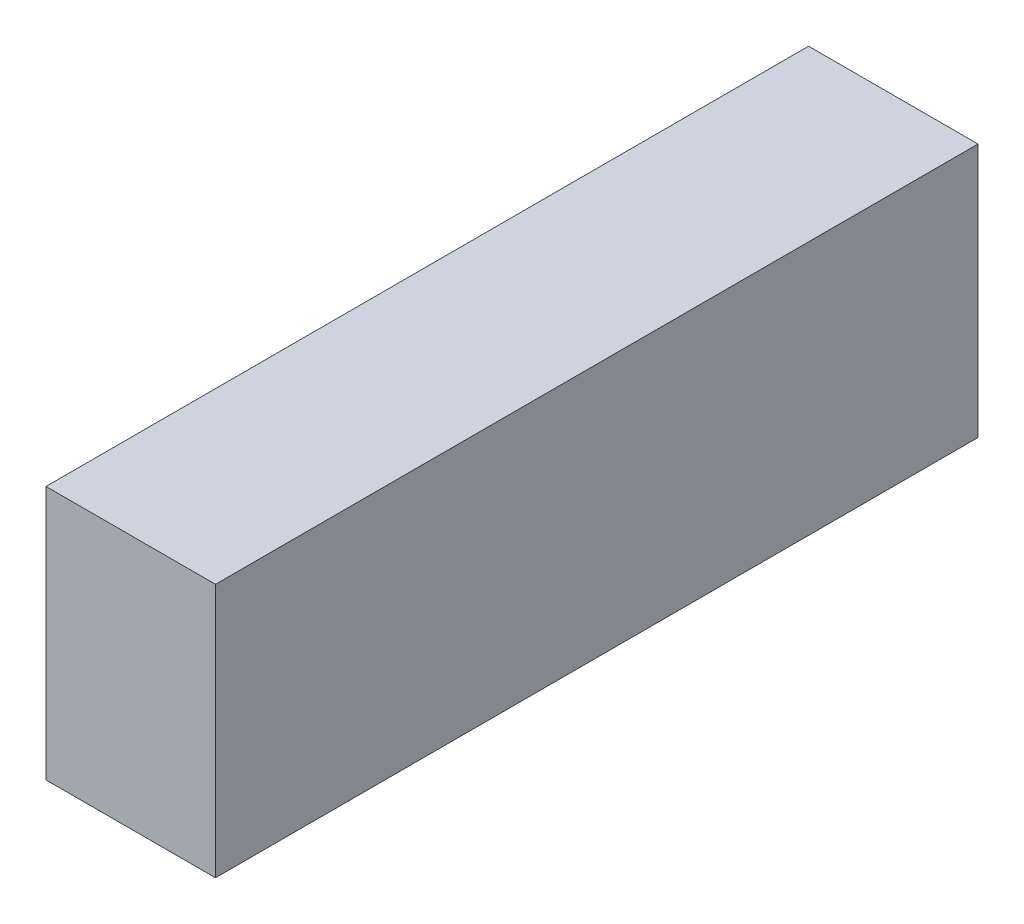
ISO-10303-21;
HEADER;
FILE_DESCRIPTION(('STEP AP214'),'2;1');
FILE_NAME('part.step','',(''),(''),'','','');
FILE_SCHEMA(('AUTOMOTIVE_DESIGN { 1 0 10303 214 1 1 1 1 }'));
ENDSEC;
DATA;
#1=APPLICATION_CONTEXT('core data for automotive mechanical design processes');
#2=APPLICATION_PROTOCOL_DEFINITION('international standard','automotive_design',2000,#1);
#3=PRODUCT_CONTEXT('',#1,'mechanical');
#4=PRODUCT('Part','Part','',(#3));
#5=PRODUCT_RELATED_PRODUCT_CATEGORY('part','',(#4));
#6=PRODUCT_DEFINITION_FORMATION('','',#4);
#7=PRODUCT_DEFINITION_CONTEXT('part definition',#1,'design');
#8=PRODUCT_DEFINITION('design','',#6,#7);
#9=PRODUCT_DEFINITION_SHAPE('','',#8);
#10=(LENGTH_UNIT() NAMED_UNIT(*) SI_UNIT(.MILLI.,.METRE.));
#11=(NAMED_UNIT(*) PLANE_ANGLE_UNIT() SI_UNIT($,.RADIAN.));
#12=(NAMED_UNIT(*) SI_UNIT($,.STERADIAN.) SOLID_ANGLE_UNIT());
#13=UNCERTAINTY_MEASURE_WITH_UNIT(LENGTH_MEASURE(1.E-05),#10,'distance_accuracy_value','');
#14=(GEOMETRIC_REPRESENTATION_CONTEXT(3) GLOBAL_UNCERTAINTY_ASSIGNED_CONTEXT((#13)) GLOBAL_UNIT_ASSIGNED_CONTEXT((#10,
#11,#12)) REPRESENTATION_CONTEXT('',''));
#15=CARTESIAN_POINT('',(0.,0.,0.));
#16=DIRECTION('',(0.,0.,1.));
#17=DIRECTION('',(1.,0.,0.));
#18=AXIS2_PLACEMENT_3D('',#15,#16,#17);
#19=CARTESIAN_POINT('',(4.23333333333333,-6.35,38.1));
#20=DIRECTION('',(-1.,0.,0.));
#21=DIRECTION('',(0.,0.,1.));
#22=AXIS2_PLACEMENT_3D('',#19,#20,#21);
#23=PLANE('',#22);
#24=DIRECTION('',(0.,1.,0.));
#25=VECTOR('',#24,1.);
#26=CARTESIAN_POINT('',(4.23333333333333,-6.35,0.));
#27=LINE('',#26,#25);
#28=CARTESIAN_POINT('',(4.23333333333333,-6.35,0.));
#29=VERTEX_POINT('',#28);
#30=CARTESIAN_POINT('',(4.23333333333333,6.35,0.));
#31=VERTEX_POINT('',#30);
#32=EDGE_CURVE('E95',#29,#31,#27,.T.);
#33=ORIENTED_EDGE('',*,*,#32,.T.);
#34=DIRECTION('',(0.,0.,-1.));
#35=VECTOR('',#34,1.);
#36=CARTESIAN_POINT('',(4.23333333333333,6.35,38.1));
#37=LINE('',#36,#35);
#38=CARTESIAN_POINT('',(4.23333333333333,6.35,38.1));
#39=VERTEX_POINT('',#38);
#40=EDGE_CURVE('E11',#39,#31,#37,.T.);
#41=ORIENTED_EDGE('',*,*,#40,.F.);
#42=DIRECTION('',(0.,1.,0.));
#43=VECTOR('',#42,1.);
#44=CARTESIAN_POINT('',(4.23333333333333,-6.35,38.1));
#45=LINE('',#44,#43);
#46=CARTESIAN_POINT('',(4.23333333333333,-6.35,38.1));
#47=VERTEX_POINT('',#46);
#48=EDGE_CURVE('E83',#47,#39,#45,.T.);
#49=ORIENTED_EDGE('',*,*,#48,.F.);
#50=DIRECTION('',(0.,0.,-1.));
#51=VECTOR('',#50,1.);
#52=CARTESIAN_POINT('',(4.23333333333333,-6.35,38.1));
#53=LINE('',#52,#51);
#54=EDGE_CURVE('E91',#47,#29,#53,.T.);
#55=ORIENTED_EDGE('',*,*,#54,.T.);
#56=EDGE_LOOP('',(#33,#41,#49,#55));
#57=FACE_BOUND('',#56,.T.);
#58=ADVANCED_FACE('F32',(#57),#23,.F.);
#59=CARTESIAN_POINT('',(-4.23333333333333,6.35,38.1));
#60=DIRECTION('',(0.,-1.,0.));
#61=DIRECTION('',(0.,0.,-1.));
#62=AXIS2_PLACEMENT_3D('',#59,#60,#61);
#63=PLANE('',#62);
#64=DIRECTION('',(-1.,0.,0.));
#65=VECTOR('',#64,1.);
#66=CARTESIAN_POINT('',(-4.23333333333333,6.35,0.));
#67=LINE('',#66,#65);
#68=CARTESIAN_POINT('',(-4.23333333333333,6.35,0.));
#69=VERTEX_POINT('',#68);
#70=EDGE_CURVE('E87',#31,#69,#67,.T.);
#71=ORIENTED_EDGE('',*,*,#70,.T.);
#72=DIRECTION('',(0.,0.,-1.));
#73=VECTOR('',#72,1.);
#74=CARTESIAN_POINT('',(-4.23333333333333,6.35,38.1));
#75=LINE('',#74,#73);
#76=CARTESIAN_POINT('',(-4.23333333333333,6.35,38.1));
#77=VERTEX_POINT('',#76);
#78=EDGE_CURVE('E40',#77,#69,#75,.T.);
#79=ORIENTED_EDGE('',*,*,#78,.F.);
#80=DIRECTION('',(-1.,0.,0.));
#81=VECTOR('',#80,1.);
#82=CARTESIAN_POINT('',(-4.23333333333333,6.35,38.1));
#83=LINE('',#82,#81);
#84=EDGE_CURVE('E78',#39,#77,#83,.T.);
#85=ORIENTED_EDGE('',*,*,#84,.F.);
#86=ORIENTED_EDGE('',*,*,#40,.T.);
#87=EDGE_LOOP('',(#71,#79,#85,#86));
#88=FACE_BOUND('',#87,.T.);
#89=ADVANCED_FACE('F86',(#88),#63,.F.);
#90=CARTESIAN_POINT('',(-4.23333333333333,-6.35,38.1));
#91=DIRECTION('',(1.,0.,0.));
#92=DIRECTION('',(0.,0.,-1.));
#93=AXIS2_PLACEMENT_3D('',#90,#91,#92);
#94=PLANE('',#93);
#95=DIRECTION('',(0.,-1.,0.));
#96=VECTOR('',#95,1.);
#97=CARTESIAN_POINT('',(-4.23333333333333,-6.35,0.));
#98=LINE('',#97,#96);
#99=CARTESIAN_POINT('',(-4.23333333333333,-6.35,0.));
#100=VERTEX_POINT('',#99);
#101=EDGE_CURVE('E65',#69,#100,#98,.T.);
#102=ORIENTED_EDGE('',*,*,#101,.T.);
#103=DIRECTION('',(0.,0.,-1.));
#104=VECTOR('',#103,1.);
#105=CARTESIAN_POINT('',(-4.23333333333333,-6.35,38.1));
#106=LINE('',#105,#104);
#107=CARTESIAN_POINT('',(-4.23333333333333,-6.35,38.1));
#108=VERTEX_POINT('',#107);
#109=EDGE_CURVE('E88',#108,#100,#106,.T.);
#110=ORIENTED_EDGE('',*,*,#109,.F.);
#111=DIRECTION('',(0.,-1.,0.));
#112=VECTOR('',#111,1.);
#113=CARTESIAN_POINT('',(-4.23333333333333,-6.35,38.1));
#114=LINE('',#113,#112);
#115=EDGE_CURVE('E81',#77,#108,#114,.T.);
#116=ORIENTED_EDGE('',*,*,#115,.F.);
#117=ORIENTED_EDGE('',*,*,#78,.T.);
#118=EDGE_LOOP('',(#102,#110,#116,#117));
#119=FACE_BOUND('',#118,.T.);
#120=ADVANCED_FACE('F89',(#119),#94,.F.);
#121=CARTESIAN_POINT('',(-4.23333333333333,-6.35,38.1));
#122=DIRECTION('',(0.,1.,0.));
#123=DIRECTION('',(0.,0.,1.));
#124=AXIS2_PLACEMENT_3D('',#121,#122,#123);
#125=PLANE('',#124);
#126=DIRECTION('',(1.,0.,0.));
#127=VECTOR('',#126,1.);
#128=CARTESIAN_POINT('',(-4.23333333333333,-6.35,0.));
#129=LINE('',#128,#127);
#130=EDGE_CURVE('E71',#100,#29,#129,.T.);
#131=ORIENTED_EDGE('',*,*,#130,.T.);
#132=ORIENTED_EDGE('',*,*,#54,.F.);
#133=DIRECTION('',(1.,0.,0.));
#134=VECTOR('',#133,1.);
#135=CARTESIAN_POINT('',(-4.23333333333333,-6.35,38.1));
#136=LINE('',#135,#134);
#137=EDGE_CURVE('E48',#108,#47,#136,.T.);
#138=ORIENTED_EDGE('',*,*,#137,.F.);
#139=ORIENTED_EDGE('',*,*,#109,.T.);
#140=EDGE_LOOP('',(#131,#132,#138,#139));
#141=FACE_BOUND('',#140,.T.);
#142=ADVANCED_FACE('F102',(#141),#125,.F.);
#143=CARTESIAN_POINT('',(0.,0.,38.1));
#144=DIRECTION('',(0.,0.,-1.));
#145=DIRECTION('',(-1.,0.,0.));
#146=AXIS2_PLACEMENT_3D('',#143,#144,#145);
#147=PLANE('',#146);
#148=ORIENTED_EDGE('',*,*,#48,.T.);
#149=ORIENTED_EDGE('',*,*,#84,.T.);
#150=ORIENTED_EDGE('',*,*,#115,.T.);
#151=ORIENTED_EDGE('',*,*,#137,.T.);
#152=EDGE_LOOP('',(#148,#149,#150,#151));
#153=FACE_BOUND('',#152,.T.);
#154=ADVANCED_FACE('F79',(#153),#147,.F.);
#155=CARTESIAN_POINT('',(0.,0.,0.));
#156=DIRECTION('',(0.,0.,-1.));
#157=DIRECTION('',(-1.,0.,0.));
#158=AXIS2_PLACEMENT_3D('',#155,#156,#157);
#159=PLANE('',#158);
#160=ORIENTED_EDGE('',*,*,#32,.F.);
#161=ORIENTED_EDGE('',*,*,#130,.F.);
#162=ORIENTED_EDGE('',*,*,#101,.F.);
#163=ORIENTED_EDGE('',*,*,#70,.F.);
#164=EDGE_LOOP('',(#160,#161,#162,#163));
#165=FACE_BOUND('',#164,.T.);
#166=ADVANCED_FACE('F105',(#165),#159,.T.);
#167=CLOSED_SHELL('',(#58,#89,#120,#142,#154,#166));
#168=MANIFOLD_SOLID_BREP('B2',#167);
#169=ADVANCED_BREP_SHAPE_REPRESENTATION('',(#18,#168),#14);
#170=SHAPE_DEFINITION_REPRESENTATION(#9,#169);
ENDSEC;
END-ISO-10303-21;
